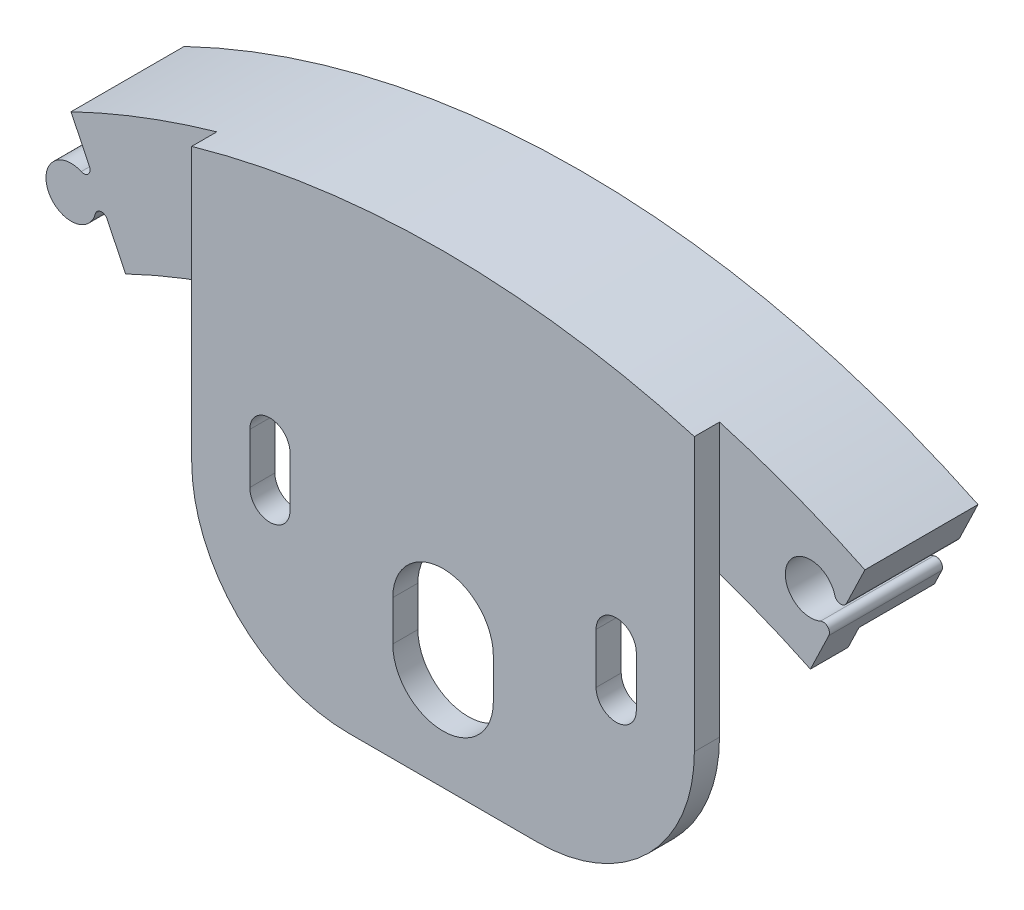
ISO-10303-21;
HEADER;
FILE_DESCRIPTION(('STEP AP214'),'2;1');
FILE_NAME('part.step','',(''),(''),'','','');
FILE_SCHEMA(('AUTOMOTIVE_DESIGN { 1 0 10303 214 1 1 1 1 }'));
ENDSEC;
DATA;
#1=APPLICATION_CONTEXT('core data for automotive mechanical design processes');
#2=APPLICATION_PROTOCOL_DEFINITION('international standard','automotive_design',2000,#1);
#3=PRODUCT_CONTEXT('',#1,'mechanical');
#4=PRODUCT('Part','Part','',(#3));
#5=PRODUCT_RELATED_PRODUCT_CATEGORY('part','',(#4));
#6=PRODUCT_DEFINITION_FORMATION('','',#4);
#7=PRODUCT_DEFINITION_CONTEXT('part definition',#1,'design');
#8=PRODUCT_DEFINITION('design','',#6,#7);
#9=PRODUCT_DEFINITION_SHAPE('','',#8);
#10=(LENGTH_UNIT() NAMED_UNIT(*) SI_UNIT(.MILLI.,.METRE.));
#11=(NAMED_UNIT(*) PLANE_ANGLE_UNIT() SI_UNIT($,.RADIAN.));
#12=(NAMED_UNIT(*) SI_UNIT($,.STERADIAN.) SOLID_ANGLE_UNIT());
#13=UNCERTAINTY_MEASURE_WITH_UNIT(LENGTH_MEASURE(1.E-05),#10,'distance_accuracy_value','');
#14=(GEOMETRIC_REPRESENTATION_CONTEXT(3) GLOBAL_UNCERTAINTY_ASSIGNED_CONTEXT((#13)) GLOBAL_UNIT_ASSIGNED_CONTEXT((#10,
#11,#12)) REPRESENTATION_CONTEXT('',''));
#15=CARTESIAN_POINT('',(0.,0.,0.));
#16=DIRECTION('',(0.,0.,1.));
#17=DIRECTION('',(1.,0.,0.));
#18=AXIS2_PLACEMENT_3D('',#15,#16,#17);
#19=CARTESIAN_POINT('',(-34.6227468924834,71.8490426771224,0.));
#20=DIRECTION('',(0.900860658472376,0.434108366674402,0.));
#21=DIRECTION('',(-0.434108366674402,0.900860658472376,0.));
#22=AXIS2_PLACEMENT_3D('',#19,#20,#21);
#23=PLANE('',#22);
#24=DIRECTION('',(0.,0.,1.));
#25=VECTOR('',#24,1.);
#26=CARTESIAN_POINT('',(-36.4835499080362,75.7105767054116,0.));
#27=LINE('',#26,#25);
#28=CARTESIAN_POINT('',(-36.4835499080361,75.7105767054116,0.));
#29=VERTEX_POINT('',#28);
#30=CARTESIAN_POINT('',(-36.4835499080361,75.7105767054116,11.43));
#31=VERTEX_POINT('',#30);
#32=EDGE_CURVE('E287',#29,#31,#27,.T.);
#33=ORIENTED_EDGE('',*,*,#32,.F.);
#34=DIRECTION('',(-0.434108366674402,0.900860658472376,0.));
#35=VECTOR('',#34,1.);
#36=CARTESIAN_POINT('',(-32.1835912822739,66.7873127087203,0.));
#37=LINE('',#36,#35);
#38=CARTESIAN_POINT('',(-35.7253821438366,74.1372287496427,0.));
#39=VERTEX_POINT('',#38);
#40=EDGE_CURVE('E664',#39,#29,#37,.T.);
#41=ORIENTED_EDGE('',*,*,#40,.F.);
#42=DIRECTION('',(0.,0.,1.));
#43=VECTOR('',#42,1.);
#44=CARTESIAN_POINT('',(-35.7253821438366,74.1372287496427,0.));
#45=LINE('',#44,#43);
#46=CARTESIAN_POINT('',(-35.7253821438366,74.1372287496427,7.62));
#47=VERTEX_POINT('',#46);
#48=EDGE_CURVE('E266',#47,#39,#45,.F.);
#49=ORIENTED_EDGE('',*,*,#48,.F.);
#50=DIRECTION('',(-0.434108366674402,0.900860658472376,0.));
#51=VECTOR('',#50,1.);
#52=CARTESIAN_POINT('',(-31.1902705636852,64.7259758967227,7.62));
#53=LINE('',#52,#51);
#54=CARTESIAN_POINT('',(-34.6227468924836,71.8490426771228,7.62));
#55=VERTEX_POINT('',#54);
#56=EDGE_CURVE('E349',#55,#47,#53,.T.);
#57=ORIENTED_EDGE('',*,*,#56,.F.);
#58=DIRECTION('',(0.,0.,1.));
#59=VECTOR('',#58,1.);
#60=CARTESIAN_POINT('',(-34.6227468924836,71.8490426771228,0.));
#61=LINE('',#60,#59);
#62=CARTESIAN_POINT('',(-34.6227468924836,71.8490426771228,11.43));
#63=VERTEX_POINT('',#62);
#64=EDGE_CURVE('E346',#63,#55,#61,.F.);
#65=ORIENTED_EDGE('',*,*,#64,.F.);
#66=DIRECTION('',(0.434108366674402,-0.900860658472376,0.));
#67=VECTOR('',#66,1.);
#68=CARTESIAN_POINT('',(-36.1568741566287,75.0326599567104,11.43));
#69=LINE('',#68,#67);
#70=EDGE_CURVE('E326',#31,#63,#69,.T.);
#71=ORIENTED_EDGE('',*,*,#70,.F.);
#72=EDGE_LOOP('',(#33,#41,#49,#57,#65,#71));
#73=FACE_BOUND('',#72,.T.);
#74=ADVANCED_FACE('F35',(#73),#23,.F.);
#75=CARTESIAN_POINT('',(-38.2751201336955,79.4284390114324,0.));
#76=DIRECTION('',(0.900860658472378,0.434108366674398,0.));
#77=DIRECTION('',(-0.434108366674398,0.900860658472378,0.));
#78=AXIS2_PLACEMENT_3D('',#75,#76,#77);
#79=PLANE('',#78);
#80=DIRECTION('',(0.,0.,1.));
#81=VECTOR('',#80,1.);
#82=CARTESIAN_POINT('',(-40.1359231492485,83.289973039722,0.));
#83=LINE('',#82,#81);
#84=CARTESIAN_POINT('',(-40.1359231492485,83.289973039722,0.));
#85=VERTEX_POINT('',#84);
#86=CARTESIAN_POINT('',(-40.1359231492485,83.289973039722,11.43));
#87=VERTEX_POINT('',#86);
#88=EDGE_CURVE('E344',#85,#87,#83,.T.);
#89=ORIENTED_EDGE('',*,*,#88,.F.);
#90=DIRECTION('',(-0.434108366674398,0.900860658472378,0.));
#91=VECTOR('',#90,1.);
#92=CARTESIAN_POINT('',(-32.183591282274,66.7873127087204,0.));
#93=LINE('',#92,#91);
#94=CARTESIAN_POINT('',(-38.2751201336955,79.4284390114324,0.));
#95=VERTEX_POINT('',#94);
#96=EDGE_CURVE('E656',#95,#85,#93,.T.);
#97=ORIENTED_EDGE('',*,*,#96,.F.);
#98=DIRECTION('',(0.,0.,1.));
#99=VECTOR('',#98,1.);
#100=CARTESIAN_POINT('',(-38.2751201336955,79.4284390114324,0.));
#101=LINE('',#100,#99);
#102=CARTESIAN_POINT('',(-38.2751201336955,79.4284390114324,11.43));
#103=VERTEX_POINT('',#102);
#104=EDGE_CURVE('E39',#95,#103,#101,.T.);
#105=ORIENTED_EDGE('',*,*,#104,.T.);
#106=DIRECTION('',(0.434108366674398,-0.900860658472378,0.));
#107=VECTOR('',#106,1.);
#108=CARTESIAN_POINT('',(-36.1568741566288,75.0326599567106,11.43));
#109=LINE('',#108,#107);
#110=EDGE_CURVE('E654',#87,#103,#109,.T.);
#111=ORIENTED_EDGE('',*,*,#110,.F.);
#112=EDGE_LOOP('',(#89,#97,#105,#111));
#113=FACE_BOUND('',#112,.T.);
#114=ADVANCED_FACE('F521',(#113),#79,.F.);
#115=CARTESIAN_POINT('',(-38.8471666518255,79.1527801985942,0.));
#116=DIRECTION('',(0.,0.,1.));
#117=DIRECTION('',(1.,0.,0.));
#118=AXIS2_PLACEMENT_3D('',#115,#116,#117);
#119=CYLINDRICAL_SURFACE('',#118,0.634999999999997);
#120=ORIENTED_EDGE('',*,*,#104,.F.);
#121=CARTESIAN_POINT('',(-38.8471666518255,79.1527801985942,0.));
#122=DIRECTION('',(0.,0.,1.));
#123=DIRECTION('',(1.,0.,0.));
#124=AXIS2_PLACEMENT_3D('',#121,#122,#123);
#125=CIRCLE('',#124,0.634999999999997);
#126=CARTESIAN_POINT('',(-39.1027649830383,78.571493270235,0.));
#127=VERTEX_POINT('',#126);
#128=EDGE_CURVE('E658',#127,#95,#125,.T.);
#129=ORIENTED_EDGE('',*,*,#128,.F.);
#130=DIRECTION('',(0.,0.,1.));
#131=VECTOR('',#130,1.);
#132=CARTESIAN_POINT('',(-39.1027649830383,78.571493270235,0.));
#133=LINE('',#132,#131);
#134=CARTESIAN_POINT('',(-39.1027649830383,78.571493270235,11.43));
#135=VERTEX_POINT('',#134);
#136=EDGE_CURVE('E647',#127,#135,#133,.T.);
#137=ORIENTED_EDGE('',*,*,#136,.T.);
#138=CARTESIAN_POINT('',(-38.8471666518255,79.1527801985942,11.43));
#139=DIRECTION('',(0.,0.,-1.));
#140=DIRECTION('',(-1.,0.,0.));
#141=AXIS2_PLACEMENT_3D('',#138,#139,#140);
#142=CIRCLE('',#141,0.634999999999997);
#143=EDGE_CURVE('E660',#103,#135,#142,.T.);
#144=ORIENTED_EDGE('',*,*,#143,.F.);
#145=EDGE_LOOP('',(#120,#129,#137,#144));
#146=FACE_BOUND('',#145,.T.);
#147=ADVANCED_FACE('F527',(#146),#119,.F.);
#148=CARTESIAN_POINT('',(-40.1251583078897,76.2463455567984,0.));
#149=DIRECTION('',(0.,0.,1.));
#150=DIRECTION('',(1.,0.,0.));
#151=AXIS2_PLACEMENT_3D('',#148,#149,#150);
#152=CYLINDRICAL_SURFACE('',#151,2.54000000000001);
#153=ORIENTED_EDGE('',*,*,#136,.F.);
#154=CARTESIAN_POINT('',(-40.1251583078897,76.2463455567984,0.));
#155=DIRECTION('',(0.,0.,1.));
#156=DIRECTION('',(1.,0.,0.));
#157=AXIS2_PLACEMENT_3D('',#154,#155,#156);
#158=CIRCLE('',#157,2.54000000000001);
#159=CARTESIAN_POINT('',(-37.6695088025108,75.5972034254183,0.));
#160=VERTEX_POINT('',#159);
#161=EDGE_CURVE('E678',#160,#127,#158,.F.);
#162=ORIENTED_EDGE('',*,*,#161,.F.);
#163=DIRECTION('',(0.,0.,1.));
#164=VECTOR('',#163,1.);
#165=CARTESIAN_POINT('',(-37.6695088025108,75.5972034254183,0.));
#166=LINE('',#165,#164);
#167=CARTESIAN_POINT('',(-37.6695088025108,75.5972034254183,11.43));
#168=VERTEX_POINT('',#167);
#169=EDGE_CURVE('E292',#160,#168,#166,.T.);
#170=ORIENTED_EDGE('',*,*,#169,.T.);
#171=CARTESIAN_POINT('',(-40.1251583078897,76.2463455567984,11.43));
#172=DIRECTION('',(0.,0.,-1.));
#173=DIRECTION('',(-1.,0.,0.));
#174=AXIS2_PLACEMENT_3D('',#171,#172,#173);
#175=CIRCLE('',#174,2.54000000000001);
#176=EDGE_CURVE('E662',#135,#168,#175,.F.);
#177=ORIENTED_EDGE('',*,*,#176,.F.);
#178=EDGE_LOOP('',(#153,#162,#170,#177));
#179=FACE_BOUND('',#178,.T.);
#180=ADVANCED_FACE('F536',(#179),#152,.T.);
#181=CARTESIAN_POINT('',(-37.0555964261661,75.4349178925733,0.));
#182=DIRECTION('',(0.,0.,1.));
#183=DIRECTION('',(1.,0.,0.));
#184=AXIS2_PLACEMENT_3D('',#181,#182,#183);
#185=CYLINDRICAL_SURFACE('',#184,0.634999999999992);
#186=ORIENTED_EDGE('',*,*,#169,.F.);
#187=CARTESIAN_POINT('',(-37.0555964261661,75.4349178925733,0.));
#188=DIRECTION('',(0.,0.,1.));
#189=DIRECTION('',(1.,0.,0.));
#190=AXIS2_PLACEMENT_3D('',#187,#188,#189);
#191=CIRCLE('',#190,0.634999999999992);
#192=EDGE_CURVE('E674',#29,#160,#191,.T.);
#193=ORIENTED_EDGE('',*,*,#192,.F.);
#194=ORIENTED_EDGE('',*,*,#32,.T.);
#195=CARTESIAN_POINT('',(-37.0555964261661,75.4349178925733,11.43));
#196=DIRECTION('',(0.,0.,-1.));
#197=DIRECTION('',(-1.,0.,0.));
#198=AXIS2_PLACEMENT_3D('',#195,#196,#197);
#199=CIRCLE('',#198,0.634999999999992);
#200=EDGE_CURVE('E666',#168,#31,#199,.T.);
#201=ORIENTED_EDGE('',*,*,#200,.F.);
#202=EDGE_LOOP('',(#186,#193,#194,#201));
#203=FACE_BOUND('',#202,.T.);
#204=ADVANCED_FACE('F532',(#203),#185,.F.);
#205=CARTESIAN_POINT('',(38.2355071541531,79.4475156169559,0.));
#206=DIRECTION('',(0.90107702132209,-0.433659084587547,0.));
#207=DIRECTION('',(0.433659084587547,0.901077021322091,0.));
#208=AXIS2_PLACEMENT_3D('',#205,#206,#207);
#209=PLANE('',#208);
#210=DIRECTION('',(0.,0.,1.));
#211=VECTOR('',#210,1.);
#212=CARTESIAN_POINT('',(40.0943843246261,83.3099770833553,0.));
#213=LINE('',#212,#211);
#214=CARTESIAN_POINT('',(40.0943843246261,83.3099770833553,0.));
#215=VERTEX_POINT('',#214);
#216=CARTESIAN_POINT('',(40.0943843246261,83.3099770833553,11.43));
#217=VERTEX_POINT('',#216);
#218=EDGE_CURVE('E299',#215,#217,#213,.T.);
#219=ORIENTED_EDGE('',*,*,#218,.T.);
#220=DIRECTION('',(-0.433659084587547,-0.901077021322091,0.));
#221=VECTOR('',#220,1.);
#222=CARTESIAN_POINT('',(36.1281283989772,75.0687059966814,11.43));
#223=LINE('',#222,#221);
#224=CARTESIAN_POINT('',(38.2355071541531,79.4475156169559,11.43));
#225=VERTEX_POINT('',#224);
#226=EDGE_CURVE('E280',#217,#225,#223,.T.);
#227=ORIENTED_EDGE('',*,*,#226,.T.);
#228=DIRECTION('',(0.,0.,1.));
#229=VECTOR('',#228,1.);
#230=CARTESIAN_POINT('',(38.2355071541531,79.4475156169559,0.));
#231=LINE('',#230,#229);
#232=CARTESIAN_POINT('',(38.2355071541531,79.4475156169559,0.));
#233=VERTEX_POINT('',#232);
#234=EDGE_CURVE('E11',#233,#225,#231,.T.);
#235=ORIENTED_EDGE('',*,*,#234,.F.);
#236=DIRECTION('',(0.433659084587547,0.901077021322091,0.));
#237=VECTOR('',#236,1.);
#238=CARTESIAN_POINT('',(32.1580043990895,66.8193976453977,0.));
#239=LINE('',#238,#237);
#240=EDGE_CURVE('E302',#233,#215,#239,.T.);
#241=ORIENTED_EDGE('',*,*,#240,.T.);
#242=EDGE_LOOP('',(#219,#227,#235,#241));
#243=FACE_BOUND('',#242,.T.);
#244=ADVANCED_FACE('F535',(#243),#209,.T.);
#245=CARTESIAN_POINT('',(37.6633232456136,79.722889135669,0.));
#246=DIRECTION('',(0.,0.,1.));
#247=DIRECTION('',(1.,0.,0.));
#248=AXIS2_PLACEMENT_3D('',#245,#246,#247);
#249=CYLINDRICAL_SURFACE('',#248,0.634999999999999);
#250=ORIENTED_EDGE('',*,*,#234,.T.);
#251=CARTESIAN_POINT('',(37.6633232456136,79.722889135669,11.43));
#252=DIRECTION('',(0.,0.,-1.));
#253=DIRECTION('',(-1.,0.,0.));
#254=AXIS2_PLACEMENT_3D('',#251,#252,#253);
#255=CIRCLE('',#254,0.634999999999999);
#256=CARTESIAN_POINT('',(37.049491871792,79.5602974860918,11.43));
#257=VERTEX_POINT('',#256);
#258=EDGE_CURVE('E314',#225,#257,#255,.T.);
#259=ORIENTED_EDGE('',*,*,#258,.T.);
#260=DIRECTION('',(0.,0.,1.));
#261=VECTOR('',#260,1.);
#262=CARTESIAN_POINT('',(37.049491871792,79.5602974860918,0.));
#263=LINE('',#262,#261);
#264=CARTESIAN_POINT('',(37.049491871792,79.5602974860918,0.));
#265=VERTEX_POINT('',#264);
#266=EDGE_CURVE('E45',#265,#257,#263,.T.);
#267=ORIENTED_EDGE('',*,*,#266,.F.);
#268=CARTESIAN_POINT('',(37.6633232456136,79.722889135669,0.));
#269=DIRECTION('',(0.,0.,1.));
#270=DIRECTION('',(1.,0.,0.));
#271=AXIS2_PLACEMENT_3D('',#268,#269,#270);
#272=CIRCLE('',#271,0.634999999999999);
#273=EDGE_CURVE('E305',#265,#233,#272,.T.);
#274=ORIENTED_EDGE('',*,*,#273,.T.);
#275=EDGE_LOOP('',(#250,#259,#267,#274));
#276=FACE_BOUND('',#275,.T.);
#277=ADVANCED_FACE('F603',(#276),#249,.T.);
#278=CARTESIAN_POINT('',(34.5941663765054,78.9099308877828,0.));
#279=DIRECTION('',(0.,0.,1.));
#280=DIRECTION('',(1.,0.,0.));
#281=AXIS2_PLACEMENT_3D('',#278,#279,#280);
#282=CYLINDRICAL_SURFACE('',#281,2.54000000000001);
#283=ORIENTED_EDGE('',*,*,#266,.T.);
#284=CARTESIAN_POINT('',(34.5941663765054,78.9099308877828,11.43));
#285=DIRECTION('',(0.,0.,-1.));
#286=DIRECTION('',(-1.,0.,0.));
#287=AXIS2_PLACEMENT_3D('',#284,#285,#286);
#288=CIRCLE('',#287,2.54000000000001);
#289=CARTESIAN_POINT('',(35.6177190451392,76.5852932956983,11.43));
#290=VERTEX_POINT('',#289);
#291=EDGE_CURVE('E317',#257,#290,#288,.F.);
#292=ORIENTED_EDGE('',*,*,#291,.T.);
#293=DIRECTION('',(0.,0.,1.));
#294=VECTOR('',#293,1.);
#295=CARTESIAN_POINT('',(35.6177190451392,76.5852932956983,0.));
#296=LINE('',#295,#294);
#297=CARTESIAN_POINT('',(35.6177190451392,76.5852932956983,0.));
#298=VERTEX_POINT('',#297);
#299=EDGE_CURVE('E329',#298,#290,#296,.T.);
#300=ORIENTED_EDGE('',*,*,#299,.F.);
#301=CARTESIAN_POINT('',(34.5941663765054,78.9099308877828,0.));
#302=DIRECTION('',(0.,0.,1.));
#303=DIRECTION('',(1.,0.,0.));
#304=AXIS2_PLACEMENT_3D('',#301,#302,#303);
#305=CIRCLE('',#304,2.54000000000001);
#306=EDGE_CURVE('E308',#298,#265,#305,.F.);
#307=ORIENTED_EDGE('',*,*,#306,.T.);
#308=EDGE_LOOP('',(#283,#292,#300,#307));
#309=FACE_BOUND('',#308,.T.);
#310=ADVANCED_FACE('F607',(#309),#282,.F.);
#311=CARTESIAN_POINT('',(34.5869139503642,71.8662989125647,0.));
#312=DIRECTION('',(0.901077021322091,-0.433659084587545,0.));
#313=DIRECTION('',(0.433659084587545,0.901077021322091,0.));
#314=AXIS2_PLACEMENT_3D('',#311,#312,#313);
#315=PLANE('',#314);
#316=DIRECTION('',(0.,0.,1.));
#317=VECTOR('',#316,1.);
#318=CARTESIAN_POINT('',(36.4457911208372,75.7287603789641,0.));
#319=LINE('',#318,#317);
#320=CARTESIAN_POINT('',(36.4457911208372,75.7287603789641,0.));
#321=VERTEX_POINT('',#320);
#322=CARTESIAN_POINT('',(36.4457911208372,75.7287603789641,11.43));
#323=VERTEX_POINT('',#322);
#324=EDGE_CURVE('E327',#321,#323,#319,.T.);
#325=ORIENTED_EDGE('',*,*,#324,.T.);
#326=DIRECTION('',(-0.433659084587545,-0.901077021322091,0.));
#327=VECTOR('',#326,1.);
#328=CARTESIAN_POINT('',(36.1281283989772,75.0687059966814,11.43));
#329=LINE('',#328,#327);
#330=CARTESIAN_POINT('',(34.5869139503642,71.8662989125647,11.43));
#331=VERTEX_POINT('',#330);
#332=EDGE_CURVE('E323',#323,#331,#329,.T.);
#333=ORIENTED_EDGE('',*,*,#332,.T.);
#334=DIRECTION('',(0.,0.,1.));
#335=VECTOR('',#334,1.);
#336=CARTESIAN_POINT('',(34.5869139503642,71.8662989125647,0.));
#337=LINE('',#336,#335);
#338=CARTESIAN_POINT('',(34.5869139503642,71.8662989125647,7.62));
#339=VERTEX_POINT('',#338);
#340=EDGE_CURVE('E289',#331,#339,#337,.F.);
#341=ORIENTED_EDGE('',*,*,#340,.T.);
#342=DIRECTION('',(0.433659084587545,0.901077021322091,0.));
#343=VECTOR('',#342,1.);
#344=CARTESIAN_POINT('',(31.1654733991177,64.7570705575768,7.62));
#345=LINE('',#344,#343);
#346=CARTESIAN_POINT('',(35.6884080252166,74.1550345467228,7.62));
#347=VERTEX_POINT('',#346);
#348=EDGE_CURVE('E286',#339,#347,#345,.T.);
#349=ORIENTED_EDGE('',*,*,#348,.T.);
#350=DIRECTION('',(0.,0.,1.));
#351=VECTOR('',#350,1.);
#352=CARTESIAN_POINT('',(35.6884080252166,74.1550345467228,0.));
#353=LINE('',#352,#351);
#354=CARTESIAN_POINT('',(35.6884080252166,74.1550345467228,0.));
#355=VERTEX_POINT('',#354);
#356=EDGE_CURVE('E264',#347,#355,#353,.F.);
#357=ORIENTED_EDGE('',*,*,#356,.T.);
#358=DIRECTION('',(0.433659084587545,0.901077021322091,0.));
#359=VECTOR('',#358,1.);
#360=CARTESIAN_POINT('',(32.1580043990896,66.8193976453978,0.));
#361=LINE('',#360,#359);
#362=EDGE_CURVE('E274',#355,#321,#361,.T.);
#363=ORIENTED_EDGE('',*,*,#362,.T.);
#364=EDGE_LOOP('',(#325,#333,#341,#349,#357,#363));
#365=FACE_BOUND('',#364,.T.);
#366=ADVANCED_FACE('F283',(#365),#315,.T.);
#367=CARTESIAN_POINT('',(35.8736072122977,76.0041338976771,0.));
#368=DIRECTION('',(0.,0.,1.));
#369=DIRECTION('',(1.,0.,0.));
#370=AXIS2_PLACEMENT_3D('',#367,#368,#369);
#371=CYLINDRICAL_SURFACE('',#370,0.634999999999999);
#372=ORIENTED_EDGE('',*,*,#299,.T.);
#373=CARTESIAN_POINT('',(35.8736072122977,76.0041338976771,11.43));
#374=DIRECTION('',(0.,0.,-1.));
#375=DIRECTION('',(-1.,0.,0.));
#376=AXIS2_PLACEMENT_3D('',#373,#374,#375);
#377=CIRCLE('',#376,0.634999999999999);
#378=EDGE_CURVE('E320',#290,#323,#377,.T.);
#379=ORIENTED_EDGE('',*,*,#378,.T.);
#380=ORIENTED_EDGE('',*,*,#324,.F.);
#381=CARTESIAN_POINT('',(35.8736072122977,76.0041338976771,0.));
#382=DIRECTION('',(0.,0.,1.));
#383=DIRECTION('',(1.,0.,0.));
#384=AXIS2_PLACEMENT_3D('',#381,#382,#383);
#385=CIRCLE('',#384,0.634999999999999);
#386=EDGE_CURVE('E278',#321,#298,#385,.T.);
#387=ORIENTED_EDGE('',*,*,#386,.T.);
#388=EDGE_LOOP('',(#372,#379,#380,#387));
#389=FACE_BOUND('',#388,.T.);
#390=ADVANCED_FACE('F612',(#389),#371,.T.);
#391=CARTESIAN_POINT('',(0.,92.456,11.43));
#392=DIRECTION('',(0.,0.,-1.));
#393=DIRECTION('',(-1.,0.,0.));
#394=AXIS2_PLACEMENT_3D('',#391,#392,#393);
#395=PLANE('',#394);
#396=ORIENTED_EDGE('',*,*,#332,.F.);
#397=ORIENTED_EDGE('',*,*,#378,.F.);
#398=ORIENTED_EDGE('',*,*,#291,.F.);
#399=ORIENTED_EDGE('',*,*,#258,.F.);
#400=ORIENTED_EDGE('',*,*,#226,.F.);
#401=CARTESIAN_POINT('',(0.,0.,11.43));
#402=DIRECTION('',(0.,0.,1.));
#403=DIRECTION('',(1.,0.,0.));
#404=AXIS2_PLACEMENT_3D('',#401,#402,#403);
#405=CIRCLE('',#404,92.456);
#406=CARTESIAN_POINT('',(25.4,88.89854855958,11.43));
#407=VERTEX_POINT('',#406);
#408=EDGE_CURVE('E341',#217,#407,#405,.T.);
#409=ORIENTED_EDGE('',*,*,#408,.T.);
#410=DIRECTION('',(0.,1.,0.));
#411=VECTOR('',#410,1.);
#412=CARTESIAN_POINT('',(25.4,88.89854855958,11.43));
#413=LINE('',#412,#411);
#414=CARTESIAN_POINT('',(25.4,75.6033037373368,11.43));
#415=VERTEX_POINT('',#414);
#416=EDGE_CURVE('E351',#415,#407,#413,.T.);
#417=ORIENTED_EDGE('',*,*,#416,.F.);
#418=CARTESIAN_POINT('',(0.,0.,11.43));
#419=DIRECTION('',(0.,0.,1.));
#420=DIRECTION('',(1.,0.,0.));
#421=AXIS2_PLACEMENT_3D('',#418,#419,#420);
#422=CIRCLE('',#421,79.756);
#423=EDGE_CURVE('E640',#331,#415,#422,.T.);
#424=ORIENTED_EDGE('',*,*,#423,.F.);
#425=EDGE_LOOP('',(#396,#397,#398,#399,#400,#409,#417,#424));
#426=FACE_BOUND('',#425,.T.);
#427=ADVANCED_FACE('F615',(#426),#395,.F.);
#428=CARTESIAN_POINT('',(0.,82.296,0.));
#429=DIRECTION('',(0.,0.,1.));
#430=DIRECTION('',(1.,0.,0.));
#431=AXIS2_PLACEMENT_3D('',#428,#429,#430);
#432=PLANE('',#431);
#433=CARTESIAN_POINT('',(0.,0.,0.));
#434=DIRECTION('',(0.,0.,1.));
#435=DIRECTION('',(1.,0.,0.));
#436=AXIS2_PLACEMENT_3D('',#433,#434,#435);
#437=CIRCLE('',#436,82.296);
#438=EDGE_CURVE('E260',#355,#39,#437,.T.);
#439=ORIENTED_EDGE('',*,*,#438,.T.);
#440=ORIENTED_EDGE('',*,*,#40,.T.);
#441=ORIENTED_EDGE('',*,*,#192,.T.);
#442=ORIENTED_EDGE('',*,*,#161,.T.);
#443=ORIENTED_EDGE('',*,*,#128,.T.);
#444=ORIENTED_EDGE('',*,*,#96,.T.);
#445=CARTESIAN_POINT('',(0.,0.,0.));
#446=DIRECTION('',(0.,0.,1.));
#447=DIRECTION('',(1.,0.,0.));
#448=AXIS2_PLACEMENT_3D('',#445,#446,#447);
#449=CIRCLE('',#448,92.456);
#450=EDGE_CURVE('E378',#215,#85,#449,.T.);
#451=ORIENTED_EDGE('',*,*,#450,.F.);
#452=ORIENTED_EDGE('',*,*,#240,.F.);
#453=ORIENTED_EDGE('',*,*,#273,.F.);
#454=ORIENTED_EDGE('',*,*,#306,.F.);
#455=ORIENTED_EDGE('',*,*,#386,.F.);
#456=ORIENTED_EDGE('',*,*,#362,.F.);
#457=EDGE_LOOP('',(#439,#440,#441,#442,#443,#444,#451,#452,#453,#454,#455,#456));
#458=FACE_BOUND('',#457,.T.);
#459=ADVANCED_FACE('F275',(#458),#432,.F.);
#460=CARTESIAN_POINT('',(0.,0.,0.));
#461=DIRECTION('',(0.,0.,1.));
#462=DIRECTION('',(1.,0.,0.));
#463=AXIS2_PLACEMENT_3D('',#460,#461,#462);
#464=CYLINDRICAL_SURFACE('',#463,92.456);
#465=ORIENTED_EDGE('',*,*,#450,.T.);
#466=ORIENTED_EDGE('',*,*,#88,.T.);
#467=CARTESIAN_POINT('',(-25.4,88.89854855958,11.43));
#468=VERTEX_POINT('',#467);
#469=EDGE_CURVE('E337',#468,#87,#405,.T.);
#470=ORIENTED_EDGE('',*,*,#469,.F.);
#471=DIRECTION('',(0.,0.,-1.));
#472=VECTOR('',#471,1.);
#473=CARTESIAN_POINT('',(-25.4,88.89854855958,13.97));
#474=LINE('',#473,#472);
#475=CARTESIAN_POINT('',(-25.4,88.89854855958,13.97));
#476=VERTEX_POINT('',#475);
#477=EDGE_CURVE('E354',#476,#468,#474,.T.);
#478=ORIENTED_EDGE('',*,*,#477,.F.);
#479=CARTESIAN_POINT('',(0.,0.,13.97));
#480=DIRECTION('',(0.,0.,1.));
#481=DIRECTION('',(1.,0.,0.));
#482=AXIS2_PLACEMENT_3D('',#479,#480,#481);
#483=CIRCLE('',#482,92.456);
#484=CARTESIAN_POINT('',(25.4,88.89854855958,13.97));
#485=VERTEX_POINT('',#484);
#486=EDGE_CURVE('E406',#485,#476,#483,.T.);
#487=ORIENTED_EDGE('',*,*,#486,.F.);
#488=DIRECTION('',(0.,0.,-1.));
#489=VECTOR('',#488,1.);
#490=CARTESIAN_POINT('',(25.4,88.89854855958,13.97));
#491=LINE('',#490,#489);
#492=EDGE_CURVE('E358',#485,#407,#491,.T.);
#493=ORIENTED_EDGE('',*,*,#492,.T.);
#494=ORIENTED_EDGE('',*,*,#408,.F.);
#495=ORIENTED_EDGE('',*,*,#218,.F.);
#496=EDGE_LOOP('',(#465,#466,#470,#478,#487,#493,#494,#495));
#497=FACE_BOUND('',#496,.T.);
#498=ADVANCED_FACE('F624',(#497),#464,.T.);
#499=CARTESIAN_POINT('',(0.,0.,0.));
#500=DIRECTION('',(0.,0.,1.));
#501=DIRECTION('',(1.,0.,0.));
#502=AXIS2_PLACEMENT_3D('',#499,#500,#501);
#503=CYLINDRICAL_SURFACE('',#502,79.756);
#504=CARTESIAN_POINT('',(-25.4,75.6033037373368,11.43));
#505=VERTEX_POINT('',#504);
#506=EDGE_CURVE('E642',#505,#63,#422,.T.);
#507=ORIENTED_EDGE('',*,*,#506,.T.);
#508=ORIENTED_EDGE('',*,*,#64,.T.);
#509=CARTESIAN_POINT('',(0.,0.,7.62));
#510=DIRECTION('',(0.,0.,1.));
#511=DIRECTION('',(1.,0.,0.));
#512=AXIS2_PLACEMENT_3D('',#509,#510,#511);
#513=CIRCLE('',#512,79.756);
#514=EDGE_CURVE('E637',#339,#55,#513,.T.);
#515=ORIENTED_EDGE('',*,*,#514,.F.);
#516=ORIENTED_EDGE('',*,*,#340,.F.);
#517=ORIENTED_EDGE('',*,*,#423,.T.);
#518=EDGE_CURVE('E295',#415,#505,#422,.T.);
#519=ORIENTED_EDGE('',*,*,#518,.T.);
#520=EDGE_LOOP('',(#507,#508,#515,#516,#517,#519));
#521=FACE_BOUND('',#520,.T.);
#522=ADVANCED_FACE('F627',(#521),#503,.F.);
#523=CARTESIAN_POINT('',(0.,79.756,7.62));
#524=DIRECTION('',(0.,0.,1.));
#525=DIRECTION('',(1.,0.,0.));
#526=AXIS2_PLACEMENT_3D('',#523,#524,#525);
#527=PLANE('',#526);
#528=ORIENTED_EDGE('',*,*,#514,.T.);
#529=ORIENTED_EDGE('',*,*,#56,.T.);
#530=CARTESIAN_POINT('',(0.,0.,7.62));
#531=DIRECTION('',(0.,0.,1.));
#532=DIRECTION('',(1.,0.,0.));
#533=AXIS2_PLACEMENT_3D('',#530,#531,#532);
#534=CIRCLE('',#533,82.296);
#535=EDGE_CURVE('E270',#347,#47,#534,.T.);
#536=ORIENTED_EDGE('',*,*,#535,.F.);
#537=ORIENTED_EDGE('',*,*,#348,.F.);
#538=EDGE_LOOP('',(#528,#529,#536,#537));
#539=FACE_BOUND('',#538,.T.);
#540=ADVANCED_FACE('F629',(#539),#527,.F.);
#541=CARTESIAN_POINT('',(0.,0.,0.));
#542=DIRECTION('',(0.,0.,1.));
#543=DIRECTION('',(1.,0.,0.));
#544=AXIS2_PLACEMENT_3D('',#541,#542,#543);
#545=CYLINDRICAL_SURFACE('',#544,82.296);
#546=ORIENTED_EDGE('',*,*,#535,.T.);
#547=ORIENTED_EDGE('',*,*,#48,.T.);
#548=ORIENTED_EDGE('',*,*,#438,.F.);
#549=ORIENTED_EDGE('',*,*,#356,.F.);
#550=EDGE_LOOP('',(#546,#547,#548,#549));
#551=FACE_BOUND('',#550,.T.);
#552=ADVANCED_FACE('F37',(#551),#545,.F.);
#553=ORIENTED_EDGE('',*,*,#200,.T.);
#554=ORIENTED_EDGE('',*,*,#70,.T.);
#555=ORIENTED_EDGE('',*,*,#506,.F.);
#556=DIRECTION('',(0.,-1.,0.));
#557=VECTOR('',#556,1.);
#558=CARTESIAN_POINT('',(-25.4,88.89854855958,11.43));
#559=LINE('',#558,#557);
#560=EDGE_CURVE('E359',#468,#505,#559,.T.);
#561=ORIENTED_EDGE('',*,*,#560,.F.);
#562=ORIENTED_EDGE('',*,*,#469,.T.);
#563=ORIENTED_EDGE('',*,*,#110,.T.);
#564=ORIENTED_EDGE('',*,*,#143,.T.);
#565=ORIENTED_EDGE('',*,*,#176,.T.);
#566=EDGE_LOOP('',(#553,#554,#555,#561,#562,#563,#564,#565));
#567=FACE_BOUND('',#566,.T.);
#568=ADVANCED_FACE('F514',(#567),#395,.F.);
#569=CARTESIAN_POINT('',(9.5504,61.3156,13.97));
#570=DIRECTION('',(0.,0.,1.));
#571=DIRECTION('',(1.,0.,0.));
#572=AXIS2_PLACEMENT_3D('',#569,#570,#571);
#573=PLANE('',#572);
#574=DIRECTION('',(0.,-1.,0.));
#575=VECTOR('',#574,1.);
#576=CARTESIAN_POINT('',(-19.5326,67.056,13.97));
#577=LINE('',#576,#575);
#578=CARTESIAN_POINT('',(-19.5326,67.056,13.97));
#579=VERTEX_POINT('',#578);
#580=CARTESIAN_POINT('',(-19.5326,61.976,13.97));
#581=VERTEX_POINT('',#580);
#582=EDGE_CURVE('E470',#579,#581,#577,.T.);
#583=ORIENTED_EDGE('',*,*,#582,.F.);
#584=CARTESIAN_POINT('',(-17.5006,67.056,13.97));
#585=DIRECTION('',(0.,0.,1.));
#586=DIRECTION('',(1.,0.,0.));
#587=AXIS2_PLACEMENT_3D('',#584,#585,#586);
#588=CIRCLE('',#587,2.032);
#589=CARTESIAN_POINT('',(-15.4686,67.056,13.97));
#590=VERTEX_POINT('',#589);
#591=EDGE_CURVE('E456',#590,#579,#588,.T.);
#592=ORIENTED_EDGE('',*,*,#591,.F.);
#593=DIRECTION('',(0.,1.,0.));
#594=VECTOR('',#593,1.);
#595=CARTESIAN_POINT('',(-15.4686,67.056,13.97));
#596=LINE('',#595,#594);
#597=CARTESIAN_POINT('',(-15.4686,61.976,13.97));
#598=VERTEX_POINT('',#597);
#599=EDGE_CURVE('E451',#598,#590,#596,.T.);
#600=ORIENTED_EDGE('',*,*,#599,.F.);
#601=CARTESIAN_POINT('',(-17.5006,61.976,13.97));
#602=DIRECTION('',(0.,0.,1.));
#603=DIRECTION('',(1.,0.,0.));
#604=AXIS2_PLACEMENT_3D('',#601,#602,#603);
#605=CIRCLE('',#604,2.032);
#606=EDGE_CURVE('E467',#581,#598,#605,.T.);
#607=ORIENTED_EDGE('',*,*,#606,.F.);
#608=EDGE_LOOP('',(#583,#592,#600,#607));
#609=FACE_BOUND('',#608,.T.);
#610=CARTESIAN_POINT('',(9.5504,61.3156,13.97));
#611=DIRECTION('',(0.,0.,1.));
#612=DIRECTION('',(1.,0.,0.));
#613=AXIS2_PLACEMENT_3D('',#610,#611,#612);
#614=CIRCLE('',#613,15.8496);
#615=CARTESIAN_POINT('',(9.5504,45.466,13.97));
#616=VERTEX_POINT('',#615);
#617=CARTESIAN_POINT('',(25.4,61.3156,13.97));
#618=VERTEX_POINT('',#617);
#619=EDGE_CURVE('E397',#616,#618,#614,.T.);
#620=ORIENTED_EDGE('',*,*,#619,.T.);
#621=DIRECTION('',(0.,1.,0.));
#622=VECTOR('',#621,1.);
#623=CARTESIAN_POINT('',(25.4,88.89854855958,13.97));
#624=LINE('',#623,#622);
#625=EDGE_CURVE('E402',#618,#485,#624,.T.);
#626=ORIENTED_EDGE('',*,*,#625,.T.);
#627=ORIENTED_EDGE('',*,*,#486,.T.);
#628=DIRECTION('',(0.,-1.,0.));
#629=VECTOR('',#628,1.);
#630=CARTESIAN_POINT('',(-25.4,88.89854855958,13.97));
#631=LINE('',#630,#629);
#632=CARTESIAN_POINT('',(-25.4,61.3156,13.97));
#633=VERTEX_POINT('',#632);
#634=EDGE_CURVE('E698',#476,#633,#631,.T.);
#635=ORIENTED_EDGE('',*,*,#634,.T.);
#636=CARTESIAN_POINT('',(-9.5504,61.3156,13.97));
#637=DIRECTION('',(0.,0.,1.));
#638=DIRECTION('',(1.,0.,0.));
#639=AXIS2_PLACEMENT_3D('',#636,#637,#638);
#640=CIRCLE('',#639,15.8496);
#641=CARTESIAN_POINT('',(-9.5504,45.466,13.97));
#642=VERTEX_POINT('',#641);
#643=EDGE_CURVE('E699',#633,#642,#640,.T.);
#644=ORIENTED_EDGE('',*,*,#643,.T.);
#645=DIRECTION('',(1.,0.,0.));
#646=VECTOR('',#645,1.);
#647=CARTESIAN_POINT('',(-9.5504,45.466,13.97));
#648=LINE('',#647,#646);
#649=EDGE_CURVE('E395',#642,#616,#648,.T.);
#650=ORIENTED_EDGE('',*,*,#649,.T.);
#651=EDGE_LOOP('',(#620,#626,#627,#635,#644,#650));
#652=FACE_BOUND('',#651,.T.);
#653=DIRECTION('',(0.,-1.,0.));
#654=VECTOR('',#653,1.);
#655=CARTESIAN_POINT('',(-5.08,59.563,13.97));
#656=LINE('',#655,#654);
#657=CARTESIAN_POINT('',(-5.08,59.563,13.97));
#658=VERTEX_POINT('',#657);
#659=CARTESIAN_POINT('',(-5.08,55.499,13.97));
#660=VERTEX_POINT('',#659);
#661=EDGE_CURVE('E439',#658,#660,#656,.T.);
#662=ORIENTED_EDGE('',*,*,#661,.F.);
#663=CARTESIAN_POINT('',(0.,59.563,13.97));
#664=DIRECTION('',(0.,0.,1.));
#665=DIRECTION('',(1.,0.,0.));
#666=AXIS2_PLACEMENT_3D('',#663,#664,#665);
#667=CIRCLE('',#666,5.08);
#668=CARTESIAN_POINT('',(5.08,59.563,13.97));
#669=VERTEX_POINT('',#668);
#670=EDGE_CURVE('E425',#669,#658,#667,.T.);
#671=ORIENTED_EDGE('',*,*,#670,.F.);
#672=DIRECTION('',(0.,1.,0.));
#673=VECTOR('',#672,1.);
#674=CARTESIAN_POINT('',(5.08,59.563,13.97));
#675=LINE('',#674,#673);
#676=CARTESIAN_POINT('',(5.08,55.499,13.97));
#677=VERTEX_POINT('',#676);
#678=EDGE_CURVE('E420',#677,#669,#675,.T.);
#679=ORIENTED_EDGE('',*,*,#678,.F.);
#680=CARTESIAN_POINT('',(0.,55.499,13.97));
#681=DIRECTION('',(0.,0.,1.));
#682=DIRECTION('',(1.,0.,0.));
#683=AXIS2_PLACEMENT_3D('',#680,#681,#682);
#684=CIRCLE('',#683,5.08);
#685=EDGE_CURVE('E436',#660,#677,#684,.T.);
#686=ORIENTED_EDGE('',*,*,#685,.F.);
#687=EDGE_LOOP('',(#662,#671,#679,#686));
#688=FACE_BOUND('',#687,.T.);
#689=DIRECTION('',(0.,-1.,0.));
#690=VECTOR('',#689,1.);
#691=CARTESIAN_POINT('',(15.4686,67.056,13.97));
#692=LINE('',#691,#690);
#693=CARTESIAN_POINT('',(15.4686,67.056,13.97));
#694=VERTEX_POINT('',#693);
#695=CARTESIAN_POINT('',(15.4686,61.976,13.97));
#696=VERTEX_POINT('',#695);
#697=EDGE_CURVE('E66',#694,#696,#692,.T.);
#698=ORIENTED_EDGE('',*,*,#697,.F.);
#699=CARTESIAN_POINT('',(17.5006,67.056,13.97));
#700=DIRECTION('',(0.,0.,1.));
#701=DIRECTION('',(1.,0.,0.));
#702=AXIS2_PLACEMENT_3D('',#699,#700,#701);
#703=CIRCLE('',#702,2.03199999999999);
#704=CARTESIAN_POINT('',(19.5326,67.056,13.97));
#705=VERTEX_POINT('',#704);
#706=EDGE_CURVE('E72',#705,#694,#703,.T.);
#707=ORIENTED_EDGE('',*,*,#706,.F.);
#708=DIRECTION('',(0.,1.,0.));
#709=VECTOR('',#708,1.);
#710=CARTESIAN_POINT('',(19.5326,67.056,13.97));
#711=LINE('',#710,#709);
#712=CARTESIAN_POINT('',(19.5326,61.976,13.97));
#713=VERTEX_POINT('',#712);
#714=EDGE_CURVE('E480',#713,#705,#711,.T.);
#715=ORIENTED_EDGE('',*,*,#714,.F.);
#716=CARTESIAN_POINT('',(17.5006,61.976,13.97));
#717=DIRECTION('',(0.,0.,1.));
#718=DIRECTION('',(1.,0.,0.));
#719=AXIS2_PLACEMENT_3D('',#716,#717,#718);
#720=CIRCLE('',#719,2.03199999999999);
#721=EDGE_CURVE('E491',#696,#713,#720,.T.);
#722=ORIENTED_EDGE('',*,*,#721,.F.);
#723=EDGE_LOOP('',(#698,#707,#715,#722));
#724=FACE_BOUND('',#723,.T.);
#725=ADVANCED_FACE('F497',(#609,#652,#688,#724),#573,.T.);
#726=CARTESIAN_POINT('',(9.5504,61.3156,11.43));
#727=DIRECTION('',(0.,0.,1.));
#728=DIRECTION('',(1.,0.,0.));
#729=AXIS2_PLACEMENT_3D('',#726,#727,#728);
#730=PLANE('',#729);
#731=ORIENTED_EDGE('',*,*,#518,.F.);
#732=CARTESIAN_POINT('',(25.4,61.3156,11.43));
#733=VERTEX_POINT('',#732);
#734=EDGE_CURVE('E370',#733,#415,#413,.T.);
#735=ORIENTED_EDGE('',*,*,#734,.F.);
#736=CARTESIAN_POINT('',(9.5504,61.3156,11.43));
#737=DIRECTION('',(0.,0.,1.));
#738=DIRECTION('',(1.,0.,0.));
#739=AXIS2_PLACEMENT_3D('',#736,#737,#738);
#740=CIRCLE('',#739,15.8496);
#741=CARTESIAN_POINT('',(9.5504,45.466,11.43));
#742=VERTEX_POINT('',#741);
#743=EDGE_CURVE('E375',#742,#733,#740,.T.);
#744=ORIENTED_EDGE('',*,*,#743,.F.);
#745=DIRECTION('',(1.,0.,0.));
#746=VECTOR('',#745,1.);
#747=CARTESIAN_POINT('',(-9.5504,45.466,11.43));
#748=LINE('',#747,#746);
#749=CARTESIAN_POINT('',(-9.5504,45.466,11.43));
#750=VERTEX_POINT('',#749);
#751=EDGE_CURVE('E396',#750,#742,#748,.T.);
#752=ORIENTED_EDGE('',*,*,#751,.F.);
#753=CARTESIAN_POINT('',(-9.5504,61.3156,11.43));
#754=DIRECTION('',(0.,0.,1.));
#755=DIRECTION('',(1.,0.,0.));
#756=AXIS2_PLACEMENT_3D('',#753,#754,#755);
#757=CIRCLE('',#756,15.8496);
#758=CARTESIAN_POINT('',(-25.4,61.3156,11.43));
#759=VERTEX_POINT('',#758);
#760=EDGE_CURVE('E364',#759,#750,#757,.T.);
#761=ORIENTED_EDGE('',*,*,#760,.F.);
#762=EDGE_CURVE('E363',#505,#759,#559,.T.);
#763=ORIENTED_EDGE('',*,*,#762,.F.);
#764=EDGE_LOOP('',(#731,#735,#744,#752,#761,#763));
#765=FACE_BOUND('',#764,.T.);
#766=CARTESIAN_POINT('',(-17.5006,67.056,11.43));
#767=DIRECTION('',(0.,0.,1.));
#768=DIRECTION('',(1.,0.,0.));
#769=AXIS2_PLACEMENT_3D('',#766,#767,#768);
#770=CIRCLE('',#769,2.032);
#771=CARTESIAN_POINT('',(-15.4686,67.056,11.43));
#772=VERTEX_POINT('',#771);
#773=CARTESIAN_POINT('',(-19.5326,67.056,11.43));
#774=VERTEX_POINT('',#773);
#775=EDGE_CURVE('E462',#772,#774,#770,.T.);
#776=ORIENTED_EDGE('',*,*,#775,.T.);
#777=DIRECTION('',(0.,-1.,0.));
#778=VECTOR('',#777,1.);
#779=CARTESIAN_POINT('',(-19.5326,67.056,11.43));
#780=LINE('',#779,#778);
#781=CARTESIAN_POINT('',(-19.5326,61.976,11.43));
#782=VERTEX_POINT('',#781);
#783=EDGE_CURVE('E459',#774,#782,#780,.T.);
#784=ORIENTED_EDGE('',*,*,#783,.T.);
#785=CARTESIAN_POINT('',(-17.5006,61.976,11.43));
#786=DIRECTION('',(0.,0.,1.));
#787=DIRECTION('',(1.,0.,0.));
#788=AXIS2_PLACEMENT_3D('',#785,#786,#787);
#789=CIRCLE('',#788,2.032);
#790=CARTESIAN_POINT('',(-15.4686,61.976,11.43));
#791=VERTEX_POINT('',#790);
#792=EDGE_CURVE('E455',#782,#791,#789,.T.);
#793=ORIENTED_EDGE('',*,*,#792,.T.);
#794=DIRECTION('',(0.,1.,0.));
#795=VECTOR('',#794,1.);
#796=CARTESIAN_POINT('',(-15.4686,67.056,11.43));
#797=LINE('',#796,#795);
#798=EDGE_CURVE('E452',#791,#772,#797,.T.);
#799=ORIENTED_EDGE('',*,*,#798,.T.);
#800=EDGE_LOOP('',(#776,#784,#793,#799));
#801=FACE_BOUND('',#800,.T.);
#802=CARTESIAN_POINT('',(0.,59.563,11.43));
#803=DIRECTION('',(0.,0.,1.));
#804=DIRECTION('',(1.,0.,0.));
#805=AXIS2_PLACEMENT_3D('',#802,#803,#804);
#806=CIRCLE('',#805,5.08);
#807=CARTESIAN_POINT('',(5.08,59.563,11.43));
#808=VERTEX_POINT('',#807);
#809=CARTESIAN_POINT('',(-5.08,59.563,11.43));
#810=VERTEX_POINT('',#809);
#811=EDGE_CURVE('E431',#808,#810,#806,.T.);
#812=ORIENTED_EDGE('',*,*,#811,.T.);
#813=DIRECTION('',(0.,-1.,0.));
#814=VECTOR('',#813,1.);
#815=CARTESIAN_POINT('',(-5.08,59.563,11.43));
#816=LINE('',#815,#814);
#817=CARTESIAN_POINT('',(-5.08,55.499,11.43));
#818=VERTEX_POINT('',#817);
#819=EDGE_CURVE('E428',#810,#818,#816,.T.);
#820=ORIENTED_EDGE('',*,*,#819,.T.);
#821=CARTESIAN_POINT('',(0.,55.499,11.43));
#822=DIRECTION('',(0.,0.,1.));
#823=DIRECTION('',(1.,0.,0.));
#824=AXIS2_PLACEMENT_3D('',#821,#822,#823);
#825=CIRCLE('',#824,5.08);
#826=CARTESIAN_POINT('',(5.08,55.499,11.43));
#827=VERTEX_POINT('',#826);
#828=EDGE_CURVE('E424',#818,#827,#825,.T.);
#829=ORIENTED_EDGE('',*,*,#828,.T.);
#830=DIRECTION('',(0.,1.,0.));
#831=VECTOR('',#830,1.);
#832=CARTESIAN_POINT('',(5.08,59.563,11.43));
#833=LINE('',#832,#831);
#834=EDGE_CURVE('E421',#827,#808,#833,.T.);
#835=ORIENTED_EDGE('',*,*,#834,.T.);
#836=EDGE_LOOP('',(#812,#820,#829,#835));
#837=FACE_BOUND('',#836,.T.);
#838=CARTESIAN_POINT('',(17.5006,67.056,11.43));
#839=DIRECTION('',(0.,0.,1.));
#840=DIRECTION('',(1.,0.,0.));
#841=AXIS2_PLACEMENT_3D('',#838,#839,#840);
#842=CIRCLE('',#841,2.03199999999999);
#843=CARTESIAN_POINT('',(19.5326,67.056,11.43));
#844=VERTEX_POINT('',#843);
#845=CARTESIAN_POINT('',(15.4686,67.056,11.43));
#846=VERTEX_POINT('',#845);
#847=EDGE_CURVE('E330',#844,#846,#842,.T.);
#848=ORIENTED_EDGE('',*,*,#847,.T.);
#849=DIRECTION('',(0.,-1.,0.));
#850=VECTOR('',#849,1.);
#851=CARTESIAN_POINT('',(15.4686,67.056,11.43));
#852=LINE('',#851,#850);
#853=CARTESIAN_POINT('',(15.4686,61.976,11.43));
#854=VERTEX_POINT('',#853);
#855=EDGE_CURVE('E54',#846,#854,#852,.T.);
#856=ORIENTED_EDGE('',*,*,#855,.T.);
#857=CARTESIAN_POINT('',(17.5006,61.976,11.43));
#858=DIRECTION('',(0.,0.,1.));
#859=DIRECTION('',(1.,0.,0.));
#860=AXIS2_PLACEMENT_3D('',#857,#858,#859);
#861=CIRCLE('',#860,2.03199999999999);
#862=CARTESIAN_POINT('',(19.5326,61.976,11.43));
#863=VERTEX_POINT('',#862);
#864=EDGE_CURVE('E484',#854,#863,#861,.T.);
#865=ORIENTED_EDGE('',*,*,#864,.T.);
#866=DIRECTION('',(0.,1.,0.));
#867=VECTOR('',#866,1.);
#868=CARTESIAN_POINT('',(19.5326,67.056,11.43));
#869=LINE('',#868,#867);
#870=EDGE_CURVE('E481',#863,#844,#869,.T.);
#871=ORIENTED_EDGE('',*,*,#870,.T.);
#872=EDGE_LOOP('',(#848,#856,#865,#871));
#873=FACE_BOUND('',#872,.T.);
#874=ADVANCED_FACE('F502',(#765,#801,#837,#873),#730,.F.);
#875=CARTESIAN_POINT('',(9.5504,61.3156,13.97));
#876=DIRECTION('',(0.,0.,-1.));
#877=DIRECTION('',(-1.,0.,0.));
#878=AXIS2_PLACEMENT_3D('',#875,#876,#877);
#879=CYLINDRICAL_SURFACE('',#878,15.8496);
#880=ORIENTED_EDGE('',*,*,#743,.T.);
#881=DIRECTION('',(0.,0.,-1.));
#882=VECTOR('',#881,1.);
#883=CARTESIAN_POINT('',(25.4,61.3156,13.97));
#884=LINE('',#883,#882);
#885=EDGE_CURVE('E269',#618,#733,#884,.T.);
#886=ORIENTED_EDGE('',*,*,#885,.F.);
#887=ORIENTED_EDGE('',*,*,#619,.F.);
#888=DIRECTION('',(0.,0.,-1.));
#889=VECTOR('',#888,1.);
#890=CARTESIAN_POINT('',(9.5504,45.466,13.97));
#891=LINE('',#890,#889);
#892=EDGE_CURVE('E393',#616,#742,#891,.T.);
#893=ORIENTED_EDGE('',*,*,#892,.T.);
#894=EDGE_LOOP('',(#880,#886,#887,#893));
#895=FACE_BOUND('',#894,.T.);
#896=ADVANCED_FACE('F504',(#895),#879,.T.);
#897=CARTESIAN_POINT('',(25.4,88.89854855958,13.97));
#898=DIRECTION('',(-1.,0.,0.));
#899=DIRECTION('',(0.,-1.,0.));
#900=AXIS2_PLACEMENT_3D('',#897,#898,#899);
#901=PLANE('',#900);
#902=ORIENTED_EDGE('',*,*,#734,.T.);
#903=ORIENTED_EDGE('',*,*,#416,.T.);
#904=ORIENTED_EDGE('',*,*,#492,.F.);
#905=ORIENTED_EDGE('',*,*,#625,.F.);
#906=ORIENTED_EDGE('',*,*,#885,.T.);
#907=EDGE_LOOP('',(#902,#903,#904,#905,#906));
#908=FACE_BOUND('',#907,.T.);
#909=ADVANCED_FACE('F511',(#908),#901,.F.);
#910=CARTESIAN_POINT('',(-25.4,88.89854855958,13.97));
#911=DIRECTION('',(1.,0.,0.));
#912=DIRECTION('',(0.,1.,0.));
#913=AXIS2_PLACEMENT_3D('',#910,#911,#912);
#914=PLANE('',#913);
#915=ORIENTED_EDGE('',*,*,#560,.T.);
#916=ORIENTED_EDGE('',*,*,#762,.T.);
#917=DIRECTION('',(0.,0.,-1.));
#918=VECTOR('',#917,1.);
#919=CARTESIAN_POINT('',(-25.4,61.3156,13.97));
#920=LINE('',#919,#918);
#921=EDGE_CURVE('E357',#633,#759,#920,.T.);
#922=ORIENTED_EDGE('',*,*,#921,.F.);
#923=ORIENTED_EDGE('',*,*,#634,.F.);
#924=ORIENTED_EDGE('',*,*,#477,.T.);
#925=EDGE_LOOP('',(#915,#916,#922,#923,#924));
#926=FACE_BOUND('',#925,.T.);
#927=ADVANCED_FACE('F546',(#926),#914,.F.);
#928=CARTESIAN_POINT('',(-9.5504,61.3156,13.97));
#929=DIRECTION('',(0.,0.,-1.));
#930=DIRECTION('',(-1.,0.,0.));
#931=AXIS2_PLACEMENT_3D('',#928,#929,#930);
#932=CYLINDRICAL_SURFACE('',#931,15.8496);
#933=ORIENTED_EDGE('',*,*,#760,.T.);
#934=DIRECTION('',(0.,0.,-1.));
#935=VECTOR('',#934,1.);
#936=CARTESIAN_POINT('',(-9.5504,45.466,13.97));
#937=LINE('',#936,#935);
#938=EDGE_CURVE('E390',#642,#750,#937,.T.);
#939=ORIENTED_EDGE('',*,*,#938,.F.);
#940=ORIENTED_EDGE('',*,*,#643,.F.);
#941=ORIENTED_EDGE('',*,*,#921,.T.);
#942=EDGE_LOOP('',(#933,#939,#940,#941));
#943=FACE_BOUND('',#942,.T.);
#944=ADVANCED_FACE('F549',(#943),#932,.T.);
#945=CARTESIAN_POINT('',(-9.5504,45.466,13.97));
#946=DIRECTION('',(0.,1.,0.));
#947=DIRECTION('',(0.,0.,1.));
#948=AXIS2_PLACEMENT_3D('',#945,#946,#947);
#949=PLANE('',#948);
#950=ORIENTED_EDGE('',*,*,#751,.T.);
#951=ORIENTED_EDGE('',*,*,#892,.F.);
#952=ORIENTED_EDGE('',*,*,#649,.F.);
#953=ORIENTED_EDGE('',*,*,#938,.T.);
#954=EDGE_LOOP('',(#950,#951,#952,#953));
#955=FACE_BOUND('',#954,.T.);
#956=ADVANCED_FACE('F552',(#955),#949,.F.);
#957=CARTESIAN_POINT('',(0.,59.563,13.97));
#958=DIRECTION('',(0.,0.,-1.));
#959=DIRECTION('',(-1.,0.,0.));
#960=AXIS2_PLACEMENT_3D('',#957,#958,#959);
#961=CYLINDRICAL_SURFACE('',#960,5.08);
#962=ORIENTED_EDGE('',*,*,#811,.F.);
#963=DIRECTION('',(0.,0.,-1.));
#964=VECTOR('',#963,1.);
#965=CARTESIAN_POINT('',(5.08,59.563,13.97));
#966=LINE('',#965,#964);
#967=EDGE_CURVE('E417',#669,#808,#966,.T.);
#968=ORIENTED_EDGE('',*,*,#967,.F.);
#969=ORIENTED_EDGE('',*,*,#670,.T.);
#970=DIRECTION('',(0.,0.,-1.));
#971=VECTOR('',#970,1.);
#972=CARTESIAN_POINT('',(-5.08,59.563,13.97));
#973=LINE('',#972,#971);
#974=EDGE_CURVE('E410',#658,#810,#973,.T.);
#975=ORIENTED_EDGE('',*,*,#974,.T.);
#976=EDGE_LOOP('',(#962,#968,#969,#975));
#977=FACE_BOUND('',#976,.T.);
#978=ADVANCED_FACE('F555',(#977),#961,.F.);
#979=CARTESIAN_POINT('',(-5.08,59.563,13.97));
#980=DIRECTION('',(1.,0.,0.));
#981=DIRECTION('',(0.,1.,0.));
#982=AXIS2_PLACEMENT_3D('',#979,#980,#981);
#983=PLANE('',#982);
#984=ORIENTED_EDGE('',*,*,#819,.F.);
#985=ORIENTED_EDGE('',*,*,#974,.F.);
#986=ORIENTED_EDGE('',*,*,#661,.T.);
#987=DIRECTION('',(0.,0.,-1.));
#988=VECTOR('',#987,1.);
#989=CARTESIAN_POINT('',(-5.08,55.499,13.97));
#990=LINE('',#989,#988);
#991=EDGE_CURVE('E413',#660,#818,#990,.T.);
#992=ORIENTED_EDGE('',*,*,#991,.T.);
#993=EDGE_LOOP('',(#984,#985,#986,#992));
#994=FACE_BOUND('',#993,.T.);
#995=ADVANCED_FACE('F559',(#994),#983,.T.);
#996=CARTESIAN_POINT('',(0.,55.499,13.97));
#997=DIRECTION('',(0.,0.,-1.));
#998=DIRECTION('',(-1.,0.,0.));
#999=AXIS2_PLACEMENT_3D('',#996,#997,#998);
#1000=CYLINDRICAL_SURFACE('',#999,5.08);
#1001=ORIENTED_EDGE('',*,*,#828,.F.);
#1002=ORIENTED_EDGE('',*,*,#991,.F.);
#1003=ORIENTED_EDGE('',*,*,#685,.T.);
#1004=DIRECTION('',(0.,0.,-1.));
#1005=VECTOR('',#1004,1.);
#1006=CARTESIAN_POINT('',(5.08,55.499,13.97));
#1007=LINE('',#1006,#1005);
#1008=EDGE_CURVE('E415',#677,#827,#1007,.T.);
#1009=ORIENTED_EDGE('',*,*,#1008,.T.);
#1010=EDGE_LOOP('',(#1001,#1002,#1003,#1009));
#1011=FACE_BOUND('',#1010,.T.);
#1012=ADVANCED_FACE('F565',(#1011),#1000,.F.);
#1013=CARTESIAN_POINT('',(5.08,59.563,13.97));
#1014=DIRECTION('',(-1.,0.,0.));
#1015=DIRECTION('',(0.,-1.,0.));
#1016=AXIS2_PLACEMENT_3D('',#1013,#1014,#1015);
#1017=PLANE('',#1016);
#1018=ORIENTED_EDGE('',*,*,#834,.F.);
#1019=ORIENTED_EDGE('',*,*,#1008,.F.);
#1020=ORIENTED_EDGE('',*,*,#678,.T.);
#1021=ORIENTED_EDGE('',*,*,#967,.T.);
#1022=EDGE_LOOP('',(#1018,#1019,#1020,#1021));
#1023=FACE_BOUND('',#1022,.T.);
#1024=ADVANCED_FACE('F571',(#1023),#1017,.T.);
#1025=CARTESIAN_POINT('',(-17.5006,67.056,13.97));
#1026=DIRECTION('',(0.,0.,-1.));
#1027=DIRECTION('',(-1.,0.,0.));
#1028=AXIS2_PLACEMENT_3D('',#1025,#1026,#1027);
#1029=CYLINDRICAL_SURFACE('',#1028,2.032);
#1030=ORIENTED_EDGE('',*,*,#775,.F.);
#1031=DIRECTION('',(0.,0.,-1.));
#1032=VECTOR('',#1031,1.);
#1033=CARTESIAN_POINT('',(-15.4686,67.056,13.97));
#1034=LINE('',#1033,#1032);
#1035=EDGE_CURVE('E448',#590,#772,#1034,.T.);
#1036=ORIENTED_EDGE('',*,*,#1035,.F.);
#1037=ORIENTED_EDGE('',*,*,#591,.T.);
#1038=DIRECTION('',(0.,0.,-1.));
#1039=VECTOR('',#1038,1.);
#1040=CARTESIAN_POINT('',(-19.5326,67.056,13.97));
#1041=LINE('',#1040,#1039);
#1042=EDGE_CURVE('E434',#579,#774,#1041,.T.);
#1043=ORIENTED_EDGE('',*,*,#1042,.T.);
#1044=EDGE_LOOP('',(#1030,#1036,#1037,#1043));
#1045=FACE_BOUND('',#1044,.T.);
#1046=ADVANCED_FACE('F575',(#1045),#1029,.F.);
#1047=CARTESIAN_POINT('',(-19.5326,67.056,13.97));
#1048=DIRECTION('',(1.,0.,0.));
#1049=DIRECTION('',(0.,0.,-1.));
#1050=AXIS2_PLACEMENT_3D('',#1047,#1048,#1049);
#1051=PLANE('',#1050);
#1052=ORIENTED_EDGE('',*,*,#783,.F.);
#1053=ORIENTED_EDGE('',*,*,#1042,.F.);
#1054=ORIENTED_EDGE('',*,*,#582,.T.);
#1055=DIRECTION('',(0.,0.,-1.));
#1056=VECTOR('',#1055,1.);
#1057=CARTESIAN_POINT('',(-19.5326,61.976,13.97));
#1058=LINE('',#1057,#1056);
#1059=EDGE_CURVE('E444',#581,#782,#1058,.T.);
#1060=ORIENTED_EDGE('',*,*,#1059,.T.);
#1061=EDGE_LOOP('',(#1052,#1053,#1054,#1060));
#1062=FACE_BOUND('',#1061,.T.);
#1063=ADVANCED_FACE('F579',(#1062),#1051,.T.);
#1064=CARTESIAN_POINT('',(-17.5006,61.976,13.97));
#1065=DIRECTION('',(0.,0.,-1.));
#1066=DIRECTION('',(-1.,0.,0.));
#1067=AXIS2_PLACEMENT_3D('',#1064,#1065,#1066);
#1068=CYLINDRICAL_SURFACE('',#1067,2.032);
#1069=ORIENTED_EDGE('',*,*,#792,.F.);
#1070=ORIENTED_EDGE('',*,*,#1059,.F.);
#1071=ORIENTED_EDGE('',*,*,#606,.T.);
#1072=DIRECTION('',(0.,0.,-1.));
#1073=VECTOR('',#1072,1.);
#1074=CARTESIAN_POINT('',(-15.4686,61.976,13.97));
#1075=LINE('',#1074,#1073);
#1076=EDGE_CURVE('E446',#598,#791,#1075,.T.);
#1077=ORIENTED_EDGE('',*,*,#1076,.T.);
#1078=EDGE_LOOP('',(#1069,#1070,#1071,#1077));
#1079=FACE_BOUND('',#1078,.T.);
#1080=ADVANCED_FACE('F583',(#1079),#1068,.F.);
#1081=CARTESIAN_POINT('',(-15.4686,67.056,13.97));
#1082=DIRECTION('',(-1.,0.,0.));
#1083=DIRECTION('',(0.,0.,1.));
#1084=AXIS2_PLACEMENT_3D('',#1081,#1082,#1083);
#1085=PLANE('',#1084);
#1086=ORIENTED_EDGE('',*,*,#798,.F.);
#1087=ORIENTED_EDGE('',*,*,#1076,.F.);
#1088=ORIENTED_EDGE('',*,*,#599,.T.);
#1089=ORIENTED_EDGE('',*,*,#1035,.T.);
#1090=EDGE_LOOP('',(#1086,#1087,#1088,#1089));
#1091=FACE_BOUND('',#1090,.T.);
#1092=ADVANCED_FACE('F587',(#1091),#1085,.T.);
#1093=CARTESIAN_POINT('',(17.5006,67.056,13.97));
#1094=DIRECTION('',(0.,0.,-1.));
#1095=DIRECTION('',(-1.,0.,0.));
#1096=AXIS2_PLACEMENT_3D('',#1093,#1094,#1095);
#1097=CYLINDRICAL_SURFACE('',#1096,2.03199999999999);
#1098=ORIENTED_EDGE('',*,*,#847,.F.);
#1099=DIRECTION('',(0.,0.,-1.));
#1100=VECTOR('',#1099,1.);
#1101=CARTESIAN_POINT('',(19.5326,67.056,13.97));
#1102=LINE('',#1101,#1100);
#1103=EDGE_CURVE('E477',#705,#844,#1102,.T.);
#1104=ORIENTED_EDGE('',*,*,#1103,.F.);
#1105=ORIENTED_EDGE('',*,*,#706,.T.);
#1106=DIRECTION('',(0.,0.,-1.));
#1107=VECTOR('',#1106,1.);
#1108=CARTESIAN_POINT('',(15.4686,67.056,13.97));
#1109=LINE('',#1108,#1107);
#1110=EDGE_CURVE('E465',#694,#846,#1109,.T.);
#1111=ORIENTED_EDGE('',*,*,#1110,.T.);
#1112=EDGE_LOOP('',(#1098,#1104,#1105,#1111));
#1113=FACE_BOUND('',#1112,.T.);
#1114=ADVANCED_FACE('F500',(#1113),#1097,.F.);
#1115=CARTESIAN_POINT('',(15.4686,67.056,13.97));
#1116=DIRECTION('',(1.,0.,0.));
#1117=DIRECTION('',(0.,0.,-1.));
#1118=AXIS2_PLACEMENT_3D('',#1115,#1116,#1117);
#1119=PLANE('',#1118);
#1120=ORIENTED_EDGE('',*,*,#855,.F.);
#1121=ORIENTED_EDGE('',*,*,#1110,.F.);
#1122=ORIENTED_EDGE('',*,*,#697,.T.);
#1123=DIRECTION('',(0.,0.,-1.));
#1124=VECTOR('',#1123,1.);
#1125=CARTESIAN_POINT('',(15.4686,61.976,13.97));
#1126=LINE('',#1125,#1124);
#1127=EDGE_CURVE('E474',#696,#854,#1126,.T.);
#1128=ORIENTED_EDGE('',*,*,#1127,.T.);
#1129=EDGE_LOOP('',(#1120,#1121,#1122,#1128));
#1130=FACE_BOUND('',#1129,.T.);
#1131=ADVANCED_FACE('F594',(#1130),#1119,.T.);
#1132=CARTESIAN_POINT('',(17.5006,61.976,13.97));
#1133=DIRECTION('',(0.,0.,-1.));
#1134=DIRECTION('',(-1.,0.,0.));
#1135=AXIS2_PLACEMENT_3D('',#1132,#1133,#1134);
#1136=CYLINDRICAL_SURFACE('',#1135,2.03199999999999);
#1137=ORIENTED_EDGE('',*,*,#864,.F.);
#1138=ORIENTED_EDGE('',*,*,#1127,.F.);
#1139=ORIENTED_EDGE('',*,*,#721,.T.);
#1140=DIRECTION('',(0.,0.,-1.));
#1141=VECTOR('',#1140,1.);
#1142=CARTESIAN_POINT('',(19.5326,61.976,13.97));
#1143=LINE('',#1142,#1141);
#1144=EDGE_CURVE('E78',#713,#863,#1143,.T.);
#1145=ORIENTED_EDGE('',*,*,#1144,.T.);
#1146=EDGE_LOOP('',(#1137,#1138,#1139,#1145));
#1147=FACE_BOUND('',#1146,.T.);
#1148=ADVANCED_FACE('F495',(#1147),#1136,.F.);
#1149=CARTESIAN_POINT('',(19.5326,67.056,13.97));
#1150=DIRECTION('',(-1.,0.,0.));
#1151=DIRECTION('',(0.,0.,1.));
#1152=AXIS2_PLACEMENT_3D('',#1149,#1150,#1151);
#1153=PLANE('',#1152);
#1154=ORIENTED_EDGE('',*,*,#870,.F.);
#1155=ORIENTED_EDGE('',*,*,#1144,.F.);
#1156=ORIENTED_EDGE('',*,*,#714,.T.);
#1157=ORIENTED_EDGE('',*,*,#1103,.T.);
#1158=EDGE_LOOP('',(#1154,#1155,#1156,#1157));
#1159=FACE_BOUND('',#1158,.T.);
#1160=ADVANCED_FACE('F499',(#1159),#1153,.T.);
#1161=CLOSED_SHELL('',(#74,#114,#147,#180,#204,#244,#277,#310,#366,#390,#427,#459,#498,#522,
#540,#552,#568,#725,#874,#896,#909,#927,#944,#956,#978,#995,#1012,#1024,#1046,#1063,#1080,#1092,
#1114,#1131,#1148,#1160));
#1162=MANIFOLD_SOLID_BREP('B2',#1161);
#1163=ADVANCED_BREP_SHAPE_REPRESENTATION('',(#18,#1162),#14);
#1164=SHAPE_DEFINITION_REPRESENTATION(#9,#1163);
ENDSEC;
END-ISO-10303-21;
